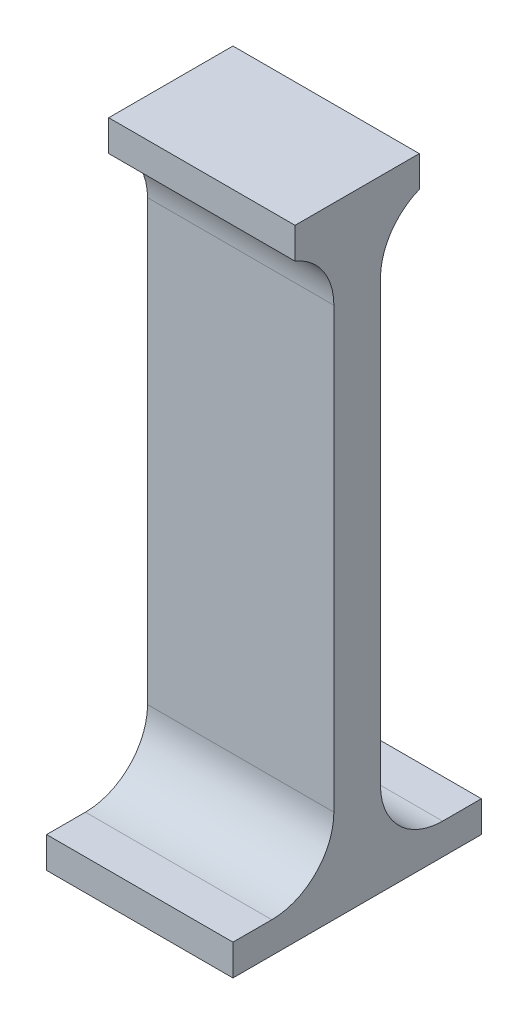
ISO-10303-21;
HEADER;
FILE_DESCRIPTION(('STEP AP214'),'2;1');
FILE_NAME('part.step','',(''),(''),'','','');
FILE_SCHEMA(('AUTOMOTIVE_DESIGN { 1 0 10303 214 1 1 1 1 }'));
ENDSEC;
DATA;
#1=APPLICATION_CONTEXT('core data for automotive mechanical design processes');
#2=APPLICATION_PROTOCOL_DEFINITION('international standard','automotive_design',2000,#1);
#3=PRODUCT_CONTEXT('',#1,'mechanical');
#4=PRODUCT('Part','Part','',(#3));
#5=PRODUCT_RELATED_PRODUCT_CATEGORY('part','',(#4));
#6=PRODUCT_DEFINITION_FORMATION('','',#4);
#7=PRODUCT_DEFINITION_CONTEXT('part definition',#1,'design');
#8=PRODUCT_DEFINITION('design','',#6,#7);
#9=PRODUCT_DEFINITION_SHAPE('','',#8);
#10=(LENGTH_UNIT() NAMED_UNIT(*) SI_UNIT(.MILLI.,.METRE.));
#11=(NAMED_UNIT(*) PLANE_ANGLE_UNIT() SI_UNIT($,.RADIAN.));
#12=(NAMED_UNIT(*) SI_UNIT($,.STERADIAN.) SOLID_ANGLE_UNIT());
#13=UNCERTAINTY_MEASURE_WITH_UNIT(LENGTH_MEASURE(1.E-05),#10,'distance_accuracy_value','');
#14=(GEOMETRIC_REPRESENTATION_CONTEXT(3) GLOBAL_UNCERTAINTY_ASSIGNED_CONTEXT((#13)) GLOBAL_UNIT_ASSIGNED_CONTEXT((#10,
#11,#12)) REPRESENTATION_CONTEXT('',''));
#15=CARTESIAN_POINT('',(0.,0.,0.));
#16=DIRECTION('',(0.,0.,1.));
#17=DIRECTION('',(1.,0.,0.));
#18=AXIS2_PLACEMENT_3D('',#15,#16,#17);
#19=CARTESIAN_POINT('',(0.,0.,3.75));
#20=DIRECTION('',(0.,0.,-1.));
#21=DIRECTION('',(-1.,0.,0.));
#22=AXIS2_PLACEMENT_3D('',#19,#20,#21);
#23=PLANE('',#22);
#24=DIRECTION('',(0.,-1.,0.));
#25=VECTOR('',#24,1.);
#26=CARTESIAN_POINT('',(-15.,0.,3.75));
#27=LINE('',#26,#25);
#28=CARTESIAN_POINT('',(-15.,85.6797518911304,3.75));
#29=VERTEX_POINT('',#28);
#30=CARTESIAN_POINT('',(-15.,15.,3.75));
#31=VERTEX_POINT('',#30);
#32=EDGE_CURVE('E142',#29,#31,#27,.T.);
#33=ORIENTED_EDGE('',*,*,#32,.T.);
#34=DIRECTION('',(-1.,0.,0.));
#35=VECTOR('',#34,1.);
#36=CARTESIAN_POINT('',(15.,15.,3.75));
#37=LINE('',#36,#35);
#38=CARTESIAN_POINT('',(15.,15.,3.75));
#39=VERTEX_POINT('',#38);
#40=EDGE_CURVE('E60',#31,#39,#37,.F.);
#41=ORIENTED_EDGE('',*,*,#40,.T.);
#42=DIRECTION('',(0.,1.,0.));
#43=VECTOR('',#42,1.);
#44=CARTESIAN_POINT('',(15.,0.,3.75));
#45=LINE('',#44,#43);
#46=CARTESIAN_POINT('',(15.,85.6797518911304,3.75));
#47=VERTEX_POINT('',#46);
#48=EDGE_CURVE('E209',#39,#47,#45,.T.);
#49=ORIENTED_EDGE('',*,*,#48,.T.);
#50=DIRECTION('',(1.,0.,0.));
#51=VECTOR('',#50,1.);
#52=CARTESIAN_POINT('',(0.,85.6797518911304,3.75));
#53=LINE('',#52,#51);
#54=EDGE_CURVE('E226',#47,#29,#53,.F.);
#55=ORIENTED_EDGE('',*,*,#54,.T.);
#56=EDGE_LOOP('',(#33,#41,#49,#55));
#57=FACE_BOUND('',#56,.T.);
#58=ADVANCED_FACE('F39',(#57),#23,.F.);
#59=CARTESIAN_POINT('',(0.,0.,-3.75));
#60=DIRECTION('',(0.,0.,-1.));
#61=DIRECTION('',(-1.,0.,0.));
#62=AXIS2_PLACEMENT_3D('',#59,#60,#61);
#63=PLANE('',#62);
#64=DIRECTION('',(0.,1.,0.));
#65=VECTOR('',#64,1.);
#66=CARTESIAN_POINT('',(15.,0.,-3.75));
#67=LINE('',#66,#65);
#68=CARTESIAN_POINT('',(15.,15.,-3.75));
#69=VERTEX_POINT('',#68);
#70=CARTESIAN_POINT('',(15.,85.6797518911304,-3.75));
#71=VERTEX_POINT('',#70);
#72=EDGE_CURVE('E210',#69,#71,#67,.T.);
#73=ORIENTED_EDGE('',*,*,#72,.F.);
#74=DIRECTION('',(-1.,0.,0.));
#75=VECTOR('',#74,1.);
#76=CARTESIAN_POINT('',(0.,15.,-3.75));
#77=LINE('',#76,#75);
#78=CARTESIAN_POINT('',(-15.,15.,-3.75));
#79=VERTEX_POINT('',#78);
#80=EDGE_CURVE('E146',#69,#79,#77,.T.);
#81=ORIENTED_EDGE('',*,*,#80,.T.);
#82=DIRECTION('',(0.,-1.,0.));
#83=VECTOR('',#82,1.);
#84=CARTESIAN_POINT('',(-15.,0.,-3.75));
#85=LINE('',#84,#83);
#86=CARTESIAN_POINT('',(-15.,85.6797518911304,-3.75));
#87=VERTEX_POINT('',#86);
#88=EDGE_CURVE('E207',#87,#79,#85,.T.);
#89=ORIENTED_EDGE('',*,*,#88,.F.);
#90=DIRECTION('',(-1.,0.,0.));
#91=VECTOR('',#90,1.);
#92=CARTESIAN_POINT('',(15.,85.6797518911304,-3.75));
#93=LINE('',#92,#91);
#94=EDGE_CURVE('E223',#87,#71,#93,.F.);
#95=ORIENTED_EDGE('',*,*,#94,.T.);
#96=EDGE_LOOP('',(#73,#81,#89,#95));
#97=FACE_BOUND('',#96,.T.);
#98=ADVANCED_FACE('F254',(#97),#63,.T.);
#99=CARTESIAN_POINT('',(-15.,0.,3.75));
#100=DIRECTION('',(1.,0.,0.));
#101=DIRECTION('',(0.,1.,0.));
#102=AXIS2_PLACEMENT_3D('',#99,#100,#101);
#103=PLANE('',#102);
#104=DIRECTION('',(0.,0.,-1.));
#105=VECTOR('',#104,1.);
#106=CARTESIAN_POINT('',(-15.,99.95,3.75));
#107=LINE('',#106,#105);
#108=CARTESIAN_POINT('',(-15.,99.95,10.));
#109=VERTEX_POINT('',#108);
#110=CARTESIAN_POINT('',(-15.,99.95,-10.));
#111=VERTEX_POINT('',#110);
#112=EDGE_CURVE('E212',#109,#111,#107,.T.);
#113=ORIENTED_EDGE('',*,*,#112,.T.);
#114=DIRECTION('',(0.,-1.,0.));
#115=VECTOR('',#114,1.);
#116=CARTESIAN_POINT('',(-15.,99.95,-10.));
#117=LINE('',#116,#115);
#118=CARTESIAN_POINT('',(-15.,94.95,-10.));
#119=VERTEX_POINT('',#118);
#120=EDGE_CURVE('E168',#111,#119,#117,.T.);
#121=ORIENTED_EDGE('',*,*,#120,.T.);
#122=CARTESIAN_POINT('',(-15.,85.6797518911304,-13.75));
#123=DIRECTION('',(1.,0.,0.));
#124=DIRECTION('',(0.,1.,0.));
#125=AXIS2_PLACEMENT_3D('',#122,#123,#124);
#126=CIRCLE('',#125,10.);
#127=EDGE_CURVE('E230',#119,#87,#126,.T.);
#128=ORIENTED_EDGE('',*,*,#127,.T.);
#129=ORIENTED_EDGE('',*,*,#88,.T.);
#130=CARTESIAN_POINT('',(-15.,15.,-13.75));
#131=DIRECTION('',(1.,0.,0.));
#132=DIRECTION('',(0.,1.,0.));
#133=AXIS2_PLACEMENT_3D('',#130,#131,#132);
#134=CIRCLE('',#133,10.);
#135=CARTESIAN_POINT('',(-15.,5.,-13.75));
#136=VERTEX_POINT('',#135);
#137=EDGE_CURVE('E241',#79,#136,#134,.T.);
#138=ORIENTED_EDGE('',*,*,#137,.T.);
#139=DIRECTION('',(0.,0.,-1.));
#140=VECTOR('',#139,1.);
#141=CARTESIAN_POINT('',(-15.,5.,20.));
#142=LINE('',#141,#140);
#143=CARTESIAN_POINT('',(-15.,5.,-20.));
#144=VERTEX_POINT('',#143);
#145=EDGE_CURVE('E190',#136,#144,#142,.T.);
#146=ORIENTED_EDGE('',*,*,#145,.T.);
#147=DIRECTION('',(0.,-1.,0.));
#148=VECTOR('',#147,1.);
#149=CARTESIAN_POINT('',(-15.,0.,-20.));
#150=LINE('',#149,#148);
#151=CARTESIAN_POINT('',(-15.,0.,-20.));
#152=VERTEX_POINT('',#151);
#153=EDGE_CURVE('E167',#144,#152,#150,.T.);
#154=ORIENTED_EDGE('',*,*,#153,.T.);
#155=DIRECTION('',(0.,0.,-1.));
#156=VECTOR('',#155,1.);
#157=CARTESIAN_POINT('',(-15.,0.,3.75));
#158=LINE('',#157,#156);
#159=CARTESIAN_POINT('',(-15.,0.,20.));
#160=VERTEX_POINT('',#159);
#161=EDGE_CURVE('E221',#160,#152,#158,.T.);
#162=ORIENTED_EDGE('',*,*,#161,.F.);
#163=DIRECTION('',(0.,-1.,0.));
#164=VECTOR('',#163,1.);
#165=CARTESIAN_POINT('',(-15.,0.,20.));
#166=LINE('',#165,#164);
#167=CARTESIAN_POINT('',(-15.,5.,20.));
#168=VERTEX_POINT('',#167);
#169=EDGE_CURVE('E179',#168,#160,#166,.T.);
#170=ORIENTED_EDGE('',*,*,#169,.F.);
#171=CARTESIAN_POINT('',(-15.,5.,13.75));
#172=VERTEX_POINT('',#171);
#173=EDGE_CURVE('E201',#168,#172,#142,.T.);
#174=ORIENTED_EDGE('',*,*,#173,.T.);
#175=CARTESIAN_POINT('',(-15.,15.,13.75));
#176=DIRECTION('',(1.,0.,0.));
#177=DIRECTION('',(0.,1.,0.));
#178=AXIS2_PLACEMENT_3D('',#175,#176,#177);
#179=CIRCLE('',#178,10.);
#180=EDGE_CURVE('E47',#172,#31,#179,.T.);
#181=ORIENTED_EDGE('',*,*,#180,.T.);
#182=ORIENTED_EDGE('',*,*,#32,.F.);
#183=CARTESIAN_POINT('',(-15.,85.6797518911304,13.75));
#184=DIRECTION('',(1.,0.,0.));
#185=DIRECTION('',(0.,1.,0.));
#186=AXIS2_PLACEMENT_3D('',#183,#184,#185);
#187=CIRCLE('',#186,10.);
#188=CARTESIAN_POINT('',(-15.,94.95,10.));
#189=VERTEX_POINT('',#188);
#190=EDGE_CURVE('E138',#29,#189,#187,.T.);
#191=ORIENTED_EDGE('',*,*,#190,.T.);
#192=DIRECTION('',(0.,-1.,0.));
#193=VECTOR('',#192,1.);
#194=CARTESIAN_POINT('',(-15.,99.95,10.));
#195=LINE('',#194,#193);
#196=EDGE_CURVE('E141',#109,#189,#195,.T.);
#197=ORIENTED_EDGE('',*,*,#196,.F.);
#198=EDGE_LOOP('',(#113,#121,#128,#129,#138,#146,#154,#162,#170,#174,#181,#182,#191,#197));
#199=FACE_BOUND('',#198,.T.);
#200=ADVANCED_FACE('F140',(#199),#103,.F.);
#201=CARTESIAN_POINT('',(-15.,0.,3.75));
#202=DIRECTION('',(0.,1.,0.));
#203=DIRECTION('',(-1.,0.,0.));
#204=AXIS2_PLACEMENT_3D('',#201,#202,#203);
#205=PLANE('',#204);
#206=ORIENTED_EDGE('',*,*,#161,.T.);
#207=DIRECTION('',(1.,0.,0.));
#208=VECTOR('',#207,1.);
#209=CARTESIAN_POINT('',(-15.,0.,-20.));
#210=LINE('',#209,#208);
#211=CARTESIAN_POINT('',(15.,0.,-20.));
#212=VERTEX_POINT('',#211);
#213=EDGE_CURVE('E193',#152,#212,#210,.T.);
#214=ORIENTED_EDGE('',*,*,#213,.T.);
#215=DIRECTION('',(0.,0.,-1.));
#216=VECTOR('',#215,1.);
#217=CARTESIAN_POINT('',(15.,0.,3.75));
#218=LINE('',#217,#216);
#219=CARTESIAN_POINT('',(15.,0.,20.));
#220=VERTEX_POINT('',#219);
#221=EDGE_CURVE('E219',#220,#212,#218,.T.);
#222=ORIENTED_EDGE('',*,*,#221,.F.);
#223=DIRECTION('',(1.,0.,0.));
#224=VECTOR('',#223,1.);
#225=CARTESIAN_POINT('',(-15.,0.,20.));
#226=LINE('',#225,#224);
#227=EDGE_CURVE('E182',#160,#220,#226,.T.);
#228=ORIENTED_EDGE('',*,*,#227,.F.);
#229=EDGE_LOOP('',(#206,#214,#222,#228));
#230=FACE_BOUND('',#229,.T.);
#231=ADVANCED_FACE('F270',(#230),#205,.F.);
#232=CARTESIAN_POINT('',(15.,0.,3.75));
#233=DIRECTION('',(-1.,0.,0.));
#234=DIRECTION('',(0.,0.,1.));
#235=AXIS2_PLACEMENT_3D('',#232,#233,#234);
#236=PLANE('',#235);
#237=DIRECTION('',(0.,0.,-1.));
#238=VECTOR('',#237,1.);
#239=CARTESIAN_POINT('',(15.,99.95,3.75));
#240=LINE('',#239,#238);
#241=CARTESIAN_POINT('',(15.,99.95,10.));
#242=VERTEX_POINT('',#241);
#243=CARTESIAN_POINT('',(15.,99.95,-10.));
#244=VERTEX_POINT('',#243);
#245=EDGE_CURVE('E217',#242,#244,#240,.T.);
#246=ORIENTED_EDGE('',*,*,#245,.F.);
#247=DIRECTION('',(0.,1.,0.));
#248=VECTOR('',#247,1.);
#249=CARTESIAN_POINT('',(15.,99.95,10.));
#250=LINE('',#249,#248);
#251=CARTESIAN_POINT('',(15.,94.95,10.));
#252=VERTEX_POINT('',#251);
#253=EDGE_CURVE('E162',#252,#242,#250,.T.);
#254=ORIENTED_EDGE('',*,*,#253,.F.);
#255=CARTESIAN_POINT('',(15.,85.6797518911304,13.75));
#256=DIRECTION('',(-1.,0.,0.));
#257=DIRECTION('',(0.,0.,1.));
#258=AXIS2_PLACEMENT_3D('',#255,#256,#257);
#259=CIRCLE('',#258,10.);
#260=EDGE_CURVE('E147',#252,#47,#259,.T.);
#261=ORIENTED_EDGE('',*,*,#260,.T.);
#262=ORIENTED_EDGE('',*,*,#48,.F.);
#263=CARTESIAN_POINT('',(15.,15.,13.75));
#264=DIRECTION('',(-1.,0.,0.));
#265=DIRECTION('',(0.,0.,1.));
#266=AXIS2_PLACEMENT_3D('',#263,#264,#265);
#267=CIRCLE('',#266,10.);
#268=CARTESIAN_POINT('',(15.,5.,13.75));
#269=VERTEX_POINT('',#268);
#270=EDGE_CURVE('E11',#39,#269,#267,.T.);
#271=ORIENTED_EDGE('',*,*,#270,.T.);
#272=DIRECTION('',(0.,0.,-1.));
#273=VECTOR('',#272,1.);
#274=CARTESIAN_POINT('',(15.,5.,20.));
#275=LINE('',#274,#273);
#276=CARTESIAN_POINT('',(15.,5.,20.));
#277=VERTEX_POINT('',#276);
#278=EDGE_CURVE('E204',#277,#269,#275,.T.);
#279=ORIENTED_EDGE('',*,*,#278,.F.);
#280=DIRECTION('',(0.,1.,0.));
#281=VECTOR('',#280,1.);
#282=CARTESIAN_POINT('',(15.,0.,20.));
#283=LINE('',#282,#281);
#284=EDGE_CURVE('E186',#220,#277,#283,.T.);
#285=ORIENTED_EDGE('',*,*,#284,.F.);
#286=ORIENTED_EDGE('',*,*,#221,.T.);
#287=DIRECTION('',(0.,1.,0.));
#288=VECTOR('',#287,1.);
#289=CARTESIAN_POINT('',(15.,0.,-20.));
#290=LINE('',#289,#288);
#291=CARTESIAN_POINT('',(15.,5.,-20.));
#292=VERTEX_POINT('',#291);
#293=EDGE_CURVE('E196',#212,#292,#290,.T.);
#294=ORIENTED_EDGE('',*,*,#293,.T.);
#295=CARTESIAN_POINT('',(15.,5.,-13.75));
#296=VERTEX_POINT('',#295);
#297=EDGE_CURVE('E203',#296,#292,#275,.T.);
#298=ORIENTED_EDGE('',*,*,#297,.F.);
#299=CARTESIAN_POINT('',(15.,15.,-13.75));
#300=DIRECTION('',(-1.,0.,0.));
#301=DIRECTION('',(0.,0.,1.));
#302=AXIS2_PLACEMENT_3D('',#299,#300,#301);
#303=CIRCLE('',#302,10.);
#304=EDGE_CURVE('E243',#296,#69,#303,.T.);
#305=ORIENTED_EDGE('',*,*,#304,.T.);
#306=ORIENTED_EDGE('',*,*,#72,.T.);
#307=CARTESIAN_POINT('',(15.,85.6797518911304,-13.75));
#308=DIRECTION('',(-1.,0.,0.));
#309=DIRECTION('',(0.,0.,1.));
#310=AXIS2_PLACEMENT_3D('',#307,#308,#309);
#311=CIRCLE('',#310,10.);
#312=CARTESIAN_POINT('',(15.,94.95,-10.));
#313=VERTEX_POINT('',#312);
#314=EDGE_CURVE('E228',#71,#313,#311,.T.);
#315=ORIENTED_EDGE('',*,*,#314,.T.);
#316=DIRECTION('',(0.,1.,0.));
#317=VECTOR('',#316,1.);
#318=CARTESIAN_POINT('',(15.,99.95,-10.));
#319=LINE('',#318,#317);
#320=EDGE_CURVE('E174',#313,#244,#319,.T.);
#321=ORIENTED_EDGE('',*,*,#320,.T.);
#322=EDGE_LOOP('',(#246,#254,#261,#262,#271,#279,#285,#286,#294,#298,#305,#306,#315,#321));
#323=FACE_BOUND('',#322,.T.);
#324=ADVANCED_FACE('F248',(#323),#236,.F.);
#325=CARTESIAN_POINT('',(-15.,99.95,3.75));
#326=DIRECTION('',(0.,-1.,0.));
#327=DIRECTION('',(0.,0.,-1.));
#328=AXIS2_PLACEMENT_3D('',#325,#326,#327);
#329=PLANE('',#328);
#330=ORIENTED_EDGE('',*,*,#245,.T.);
#331=DIRECTION('',(-1.,0.,0.));
#332=VECTOR('',#331,1.);
#333=CARTESIAN_POINT('',(-15.,99.95,-10.));
#334=LINE('',#333,#332);
#335=EDGE_CURVE('E158',#244,#111,#334,.T.);
#336=ORIENTED_EDGE('',*,*,#335,.T.);
#337=ORIENTED_EDGE('',*,*,#112,.F.);
#338=DIRECTION('',(-1.,0.,0.));
#339=VECTOR('',#338,1.);
#340=CARTESIAN_POINT('',(-15.,99.95,10.));
#341=LINE('',#340,#339);
#342=EDGE_CURVE('E157',#242,#109,#341,.T.);
#343=ORIENTED_EDGE('',*,*,#342,.F.);
#344=EDGE_LOOP('',(#330,#336,#337,#343));
#345=FACE_BOUND('',#344,.T.);
#346=ADVANCED_FACE('F292',(#345),#329,.F.);
#347=CARTESIAN_POINT('',(0.,0.,-20.));
#348=DIRECTION('',(0.,0.,-1.));
#349=DIRECTION('',(-1.,0.,0.));
#350=AXIS2_PLACEMENT_3D('',#347,#348,#349);
#351=PLANE('',#350);
#352=ORIENTED_EDGE('',*,*,#153,.F.);
#353=DIRECTION('',(-1.,0.,0.));
#354=VECTOR('',#353,1.);
#355=CARTESIAN_POINT('',(-15.,5.,-20.));
#356=LINE('',#355,#354);
#357=EDGE_CURVE('E183',#292,#144,#356,.T.);
#358=ORIENTED_EDGE('',*,*,#357,.F.);
#359=ORIENTED_EDGE('',*,*,#293,.F.);
#360=ORIENTED_EDGE('',*,*,#213,.F.);
#361=EDGE_LOOP('',(#352,#358,#359,#360));
#362=FACE_BOUND('',#361,.T.);
#363=ADVANCED_FACE('F266',(#362),#351,.T.);
#364=CARTESIAN_POINT('',(-15.,5.,20.));
#365=DIRECTION('',(0.,-1.,0.));
#366=DIRECTION('',(0.,0.,-1.));
#367=AXIS2_PLACEMENT_3D('',#364,#365,#366);
#368=PLANE('',#367);
#369=ORIENTED_EDGE('',*,*,#145,.F.);
#370=DIRECTION('',(-1.,0.,0.));
#371=VECTOR('',#370,1.);
#372=CARTESIAN_POINT('',(-15.,5.,-13.75));
#373=LINE('',#372,#371);
#374=EDGE_CURVE('E235',#136,#296,#373,.F.);
#375=ORIENTED_EDGE('',*,*,#374,.T.);
#376=ORIENTED_EDGE('',*,*,#297,.T.);
#377=ORIENTED_EDGE('',*,*,#357,.T.);
#378=EDGE_LOOP('',(#369,#375,#376,#377));
#379=FACE_BOUND('',#378,.T.);
#380=ADVANCED_FACE('F260',(#379),#368,.F.);
#381=ORIENTED_EDGE('',*,*,#278,.T.);
#382=DIRECTION('',(-1.,0.,0.));
#383=VECTOR('',#382,1.);
#384=CARTESIAN_POINT('',(-15.,5.,13.75));
#385=LINE('',#384,#383);
#386=EDGE_CURVE('E237',#269,#172,#385,.T.);
#387=ORIENTED_EDGE('',*,*,#386,.T.);
#388=ORIENTED_EDGE('',*,*,#173,.F.);
#389=DIRECTION('',(-1.,0.,0.));
#390=VECTOR('',#389,1.);
#391=CARTESIAN_POINT('',(-15.,5.,20.));
#392=LINE('',#391,#390);
#393=EDGE_CURVE('E188',#277,#168,#392,.T.);
#394=ORIENTED_EDGE('',*,*,#393,.F.);
#395=EDGE_LOOP('',(#381,#387,#388,#394));
#396=FACE_BOUND('',#395,.T.);
#397=ADVANCED_FACE('F278',(#396),#368,.F.);
#398=CARTESIAN_POINT('',(0.,0.,20.));
#399=DIRECTION('',(0.,0.,-1.));
#400=DIRECTION('',(-1.,0.,0.));
#401=AXIS2_PLACEMENT_3D('',#398,#399,#400);
#402=PLANE('',#401);
#403=ORIENTED_EDGE('',*,*,#169,.T.);
#404=ORIENTED_EDGE('',*,*,#227,.T.);
#405=ORIENTED_EDGE('',*,*,#284,.T.);
#406=ORIENTED_EDGE('',*,*,#393,.T.);
#407=EDGE_LOOP('',(#403,#404,#405,#406));
#408=FACE_BOUND('',#407,.T.);
#409=ADVANCED_FACE('F273',(#408),#402,.F.);
#410=CARTESIAN_POINT('',(0.,0.,-10.));
#411=DIRECTION('',(0.,0.,1.));
#412=DIRECTION('',(1.,0.,0.));
#413=AXIS2_PLACEMENT_3D('',#410,#411,#412);
#414=PLANE('',#413);
#415=ORIENTED_EDGE('',*,*,#120,.F.);
#416=ORIENTED_EDGE('',*,*,#335,.F.);
#417=ORIENTED_EDGE('',*,*,#320,.F.);
#418=DIRECTION('',(1.,0.,0.));
#419=VECTOR('',#418,1.);
#420=CARTESIAN_POINT('',(-15.,94.95,-10.));
#421=LINE('',#420,#419);
#422=EDGE_CURVE('E171',#119,#313,#421,.T.);
#423=ORIENTED_EDGE('',*,*,#422,.F.);
#424=EDGE_LOOP('',(#415,#416,#417,#423));
#425=FACE_BOUND('',#424,.T.);
#426=ADVANCED_FACE('F339',(#425),#414,.F.);
#427=CARTESIAN_POINT('',(0.,0.,10.));
#428=DIRECTION('',(0.,0.,1.));
#429=DIRECTION('',(1.,0.,0.));
#430=AXIS2_PLACEMENT_3D('',#427,#428,#429);
#431=PLANE('',#430);
#432=ORIENTED_EDGE('',*,*,#196,.T.);
#433=DIRECTION('',(1.,0.,0.));
#434=VECTOR('',#433,1.);
#435=CARTESIAN_POINT('',(-15.,94.95,10.));
#436=LINE('',#435,#434);
#437=EDGE_CURVE('E154',#189,#252,#436,.T.);
#438=ORIENTED_EDGE('',*,*,#437,.T.);
#439=ORIENTED_EDGE('',*,*,#253,.T.);
#440=ORIENTED_EDGE('',*,*,#342,.T.);
#441=EDGE_LOOP('',(#432,#438,#439,#440));
#442=FACE_BOUND('',#441,.T.);
#443=ADVANCED_FACE('F152',(#442),#431,.T.);
#444=CARTESIAN_POINT('',(-15.,85.6797518911304,-13.75));
#445=DIRECTION('',(1.,0.,0.));
#446=DIRECTION('',(0.,0.,-1.));
#447=AXIS2_PLACEMENT_3D('',#444,#445,#446);
#448=CYLINDRICAL_SURFACE('',#447,10.);
#449=ORIENTED_EDGE('',*,*,#127,.F.);
#450=ORIENTED_EDGE('',*,*,#422,.T.);
#451=ORIENTED_EDGE('',*,*,#314,.F.);
#452=ORIENTED_EDGE('',*,*,#94,.F.);
#453=EDGE_LOOP('',(#449,#450,#451,#452));
#454=FACE_BOUND('',#453,.T.);
#455=ADVANCED_FACE('F302',(#454),#448,.F.);
#456=CARTESIAN_POINT('',(-15.,85.6797518911304,13.75));
#457=DIRECTION('',(1.,0.,0.));
#458=DIRECTION('',(0.,0.,-1.));
#459=AXIS2_PLACEMENT_3D('',#456,#457,#458);
#460=CYLINDRICAL_SURFACE('',#459,10.);
#461=ORIENTED_EDGE('',*,*,#190,.F.);
#462=ORIENTED_EDGE('',*,*,#54,.F.);
#463=ORIENTED_EDGE('',*,*,#260,.F.);
#464=ORIENTED_EDGE('',*,*,#437,.F.);
#465=EDGE_LOOP('',(#461,#462,#463,#464));
#466=FACE_BOUND('',#465,.T.);
#467=ADVANCED_FACE('F160',(#466),#460,.F.);
#468=CARTESIAN_POINT('',(0.,15.,-13.75));
#469=DIRECTION('',(-1.,0.,0.));
#470=DIRECTION('',(0.,0.,1.));
#471=AXIS2_PLACEMENT_3D('',#468,#469,#470);
#472=CYLINDRICAL_SURFACE('',#471,10.);
#473=ORIENTED_EDGE('',*,*,#304,.F.);
#474=ORIENTED_EDGE('',*,*,#374,.F.);
#475=ORIENTED_EDGE('',*,*,#137,.F.);
#476=ORIENTED_EDGE('',*,*,#80,.F.);
#477=EDGE_LOOP('',(#473,#474,#475,#476));
#478=FACE_BOUND('',#477,.T.);
#479=ADVANCED_FACE('F257',(#478),#472,.F.);
#480=CARTESIAN_POINT('',(-15.,15.,13.75));
#481=DIRECTION('',(1.,0.,0.));
#482=DIRECTION('',(0.,0.,-1.));
#483=AXIS2_PLACEMENT_3D('',#480,#481,#482);
#484=CYLINDRICAL_SURFACE('',#483,10.);
#485=ORIENTED_EDGE('',*,*,#270,.F.);
#486=ORIENTED_EDGE('',*,*,#40,.F.);
#487=ORIENTED_EDGE('',*,*,#180,.F.);
#488=ORIENTED_EDGE('',*,*,#386,.F.);
#489=EDGE_LOOP('',(#485,#486,#487,#488));
#490=FACE_BOUND('',#489,.T.);
#491=ADVANCED_FACE('F41',(#490),#484,.F.);
#492=CLOSED_SHELL('',(#58,#98,#200,#231,#324,#346,#363,#380,#397,#409,#426,#443,#455,#467,#479,#491));
#493=MANIFOLD_SOLID_BREP('B2',#492);
#494=ADVANCED_BREP_SHAPE_REPRESENTATION('',(#18,#493),#14);
#495=SHAPE_DEFINITION_REPRESENTATION(#9,#494);
ENDSEC;
END-ISO-10303-21;
